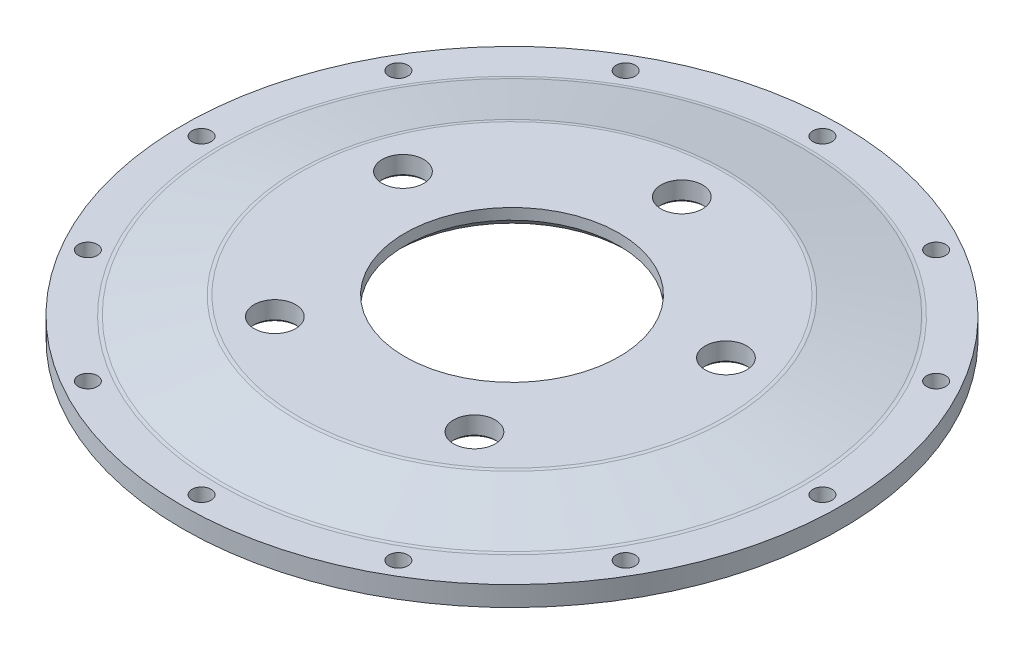
ISO-10303-21;
HEADER;
FILE_DESCRIPTION(('STEP AP214'),'2;1');
FILE_NAME('part.step','',(''),(''),'','','');
FILE_SCHEMA(('AUTOMOTIVE_DESIGN { 1 0 10303 214 1 1 1 1 }'));
ENDSEC;
DATA;
#1=APPLICATION_CONTEXT('core data for automotive mechanical design processes');
#2=APPLICATION_PROTOCOL_DEFINITION('international standard','automotive_design',2000,#1);
#3=PRODUCT_CONTEXT('',#1,'mechanical');
#4=PRODUCT('Part','Part','',(#3));
#5=PRODUCT_RELATED_PRODUCT_CATEGORY('part','',(#4));
#6=PRODUCT_DEFINITION_FORMATION('','',#4);
#7=PRODUCT_DEFINITION_CONTEXT('part definition',#1,'design');
#8=PRODUCT_DEFINITION('design','',#6,#7);
#9=PRODUCT_DEFINITION_SHAPE('','',#8);
#10=(LENGTH_UNIT() NAMED_UNIT(*) SI_UNIT(.MILLI.,.METRE.));
#11=(NAMED_UNIT(*) PLANE_ANGLE_UNIT() SI_UNIT($,.RADIAN.));
#12=(NAMED_UNIT(*) SI_UNIT($,.STERADIAN.) SOLID_ANGLE_UNIT());
#13=UNCERTAINTY_MEASURE_WITH_UNIT(LENGTH_MEASURE(1.E-05),#10,'distance_accuracy_value','');
#14=(GEOMETRIC_REPRESENTATION_CONTEXT(3) GLOBAL_UNCERTAINTY_ASSIGNED_CONTEXT((#13)) GLOBAL_UNIT_ASSIGNED_CONTEXT((#10,
#11,#12)) REPRESENTATION_CONTEXT('',''));
#15=CARTESIAN_POINT('',(0.,0.,0.));
#16=DIRECTION('',(0.,0.,1.));
#17=DIRECTION('',(1.,0.,0.));
#18=AXIS2_PLACEMENT_3D('',#15,#16,#17);
#19=CARTESIAN_POINT('',(0.,6.7,0.));
#20=DIRECTION('',(0.,1.,0.));
#21=DIRECTION('',(0.,0.,1.));
#22=AXIS2_PLACEMENT_3D('',#19,#20,#21);
#23=PLANE('',#22);
#24=CARTESIAN_POINT('',(0.,6.7,0.));
#25=DIRECTION('',(0.,1.,0.));
#26=DIRECTION('',(0.,0.,1.));
#27=AXIS2_PLACEMENT_3D('',#24,#25,#26);
#28=CIRCLE('',#27,98.6428439856109);
#29=CARTESIAN_POINT('',(0.,6.7,98.6428439856109));
#30=VERTEX_POINT('',#29);
#31=EDGE_CURVE('E91',#30,#30,#28,.F.);
#32=ORIENTED_EDGE('',*,*,#31,.T.);
#33=EDGE_LOOP('',(#32));
#34=FACE_BOUND('',#33,.T.);
#35=CARTESIAN_POINT('',(-90.4996546954717,6.7,-52.2499999999962));
#36=DIRECTION('',(0.,1.,0.));
#37=DIRECTION('',(0.,0.,1.));
#38=AXIS2_PLACEMENT_3D('',#35,#36,#37);
#39=CIRCLE('',#38,3.2125);
#40=CARTESIAN_POINT('',(-90.4996546954717,6.7,-49.0374999999962));
#41=VERTEX_POINT('',#40);
#42=EDGE_CURVE('E167',#41,#41,#39,.T.);
#43=ORIENTED_EDGE('',*,*,#42,.F.);
#44=EDGE_LOOP('',(#43));
#45=FACE_BOUND('',#44,.T.);
#46=CARTESIAN_POINT('',(-90.4996546954674,6.7,52.2500000000038));
#47=DIRECTION('',(0.,1.,0.));
#48=DIRECTION('',(0.,0.,1.));
#49=AXIS2_PLACEMENT_3D('',#46,#47,#48);
#50=CIRCLE('',#49,3.2125);
#51=CARTESIAN_POINT('',(-90.4996546954674,6.7,55.4625000000038));
#52=VERTEX_POINT('',#51);
#53=EDGE_CURVE('E155',#52,#52,#50,.T.);
#54=ORIENTED_EDGE('',*,*,#53,.F.);
#55=EDGE_LOOP('',(#54));
#56=FACE_BOUND('',#55,.T.);
#57=CARTESIAN_POINT('',(8.62839401912992E-12,6.7,104.5));
#58=DIRECTION('',(0.,1.,0.));
#59=DIRECTION('',(0.,0.,1.));
#60=AXIS2_PLACEMENT_3D('',#57,#58,#59);
#61=CIRCLE('',#60,3.2125);
#62=CARTESIAN_POINT('',(8.62839401912992E-12,6.7,107.7125));
#63=VERTEX_POINT('',#62);
#64=EDGE_CURVE('E143',#63,#63,#61,.T.);
#65=ORIENTED_EDGE('',*,*,#64,.F.);
#66=EDGE_LOOP('',(#65));
#67=FACE_BOUND('',#66,.T.);
#68=CARTESIAN_POINT('',(90.4996546954803,6.7,52.2499999999962));
#69=DIRECTION('',(0.,1.,0.));
#70=DIRECTION('',(0.,0.,1.));
#71=AXIS2_PLACEMENT_3D('',#68,#69,#70);
#72=CIRCLE('',#71,3.2125);
#73=CARTESIAN_POINT('',(90.4996546954803,6.7,55.4624999999963));
#74=VERTEX_POINT('',#73);
#75=EDGE_CURVE('E131',#74,#74,#72,.T.);
#76=ORIENTED_EDGE('',*,*,#75,.F.);
#77=EDGE_LOOP('',(#76));
#78=FACE_BOUND('',#77,.T.);
#79=CARTESIAN_POINT('',(90.499654695476,6.7,-52.2500000000037));
#80=DIRECTION('',(0.,1.,0.));
#81=DIRECTION('',(0.,0.,1.));
#82=AXIS2_PLACEMENT_3D('',#79,#80,#81);
#83=CIRCLE('',#82,3.2125);
#84=CARTESIAN_POINT('',(90.499654695476,6.7,-49.0375000000037));
#85=VERTEX_POINT('',#84);
#86=EDGE_CURVE('E119',#85,#85,#83,.T.);
#87=ORIENTED_EDGE('',*,*,#86,.F.);
#88=EDGE_LOOP('',(#87));
#89=FACE_BOUND('',#88,.T.);
#90=CARTESIAN_POINT('',(0.,6.7,-104.5));
#91=DIRECTION('',(0.,1.,0.));
#92=DIRECTION('',(0.,0.,1.));
#93=AXIS2_PLACEMENT_3D('',#90,#91,#92);
#94=CIRCLE('',#93,3.2125);
#95=CARTESIAN_POINT('',(0.,6.7,-101.2875));
#96=VERTEX_POINT('',#95);
#97=EDGE_CURVE('E107',#96,#96,#94,.T.);
#98=ORIENTED_EDGE('',*,*,#97,.F.);
#99=EDGE_LOOP('',(#98));
#100=FACE_BOUND('',#99,.T.);
#101=CARTESIAN_POINT('',(0.,6.7,0.));
#102=DIRECTION('',(0.,1.,0.));
#103=DIRECTION('',(0.,0.,1.));
#104=AXIS2_PLACEMENT_3D('',#101,#102,#103);
#105=CIRCLE('',#104,110.925);
#106=CARTESIAN_POINT('',(0.,6.7,110.925));
#107=VERTEX_POINT('',#106);
#108=EDGE_CURVE('E103',#107,#107,#105,.T.);
#109=ORIENTED_EDGE('',*,*,#108,.T.);
#110=EDGE_LOOP('',(#109));
#111=FACE_BOUND('',#110,.T.);
#112=CARTESIAN_POINT('',(52.2500000000006,6.7,-90.499654695476));
#113=DIRECTION('',(0.,1.,0.));
#114=DIRECTION('',(0.,0.,1.));
#115=AXIS2_PLACEMENT_3D('',#112,#113,#114);
#116=CIRCLE('',#115,3.21250000000001);
#117=CARTESIAN_POINT('',(52.2500000000006,6.7,-87.287154695476));
#118=VERTEX_POINT('',#117);
#119=EDGE_CURVE('E113',#118,#118,#116,.T.);
#120=ORIENTED_EDGE('',*,*,#119,.F.);
#121=EDGE_LOOP('',(#120));
#122=FACE_BOUND('',#121,.T.);
#123=CARTESIAN_POINT('',(104.500000000004,6.7,-4.31333762133219E-12));
#124=DIRECTION('',(0.,1.,0.));
#125=DIRECTION('',(0.,0.,1.));
#126=AXIS2_PLACEMENT_3D('',#123,#124,#125);
#127=CIRCLE('',#126,3.21249999999999);
#128=CARTESIAN_POINT('',(104.500000000004,6.7,3.21249999999568));
#129=VERTEX_POINT('',#128);
#130=EDGE_CURVE('E125',#129,#129,#127,.T.);
#131=ORIENTED_EDGE('',*,*,#130,.F.);
#132=EDGE_LOOP('',(#131));
#133=FACE_BOUND('',#132,.T.);
#134=CARTESIAN_POINT('',(52.2500000000081,6.7,90.4996546954717));
#135=DIRECTION('',(0.,1.,0.));
#136=DIRECTION('',(0.,0.,1.));
#137=AXIS2_PLACEMENT_3D('',#134,#135,#136);
#138=CIRCLE('',#137,3.2125);
#139=CARTESIAN_POINT('',(52.2500000000081,6.7,93.7121546954717));
#140=VERTEX_POINT('',#139);
#141=EDGE_CURVE('E137',#140,#140,#138,.T.);
#142=ORIENTED_EDGE('',*,*,#141,.F.);
#143=EDGE_LOOP('',(#142));
#144=FACE_BOUND('',#143,.T.);
#145=CARTESIAN_POINT('',(-52.2499999999919,6.7,90.499654695476));
#146=DIRECTION('',(0.,1.,0.));
#147=DIRECTION('',(0.,0.,1.));
#148=AXIS2_PLACEMENT_3D('',#145,#146,#147);
#149=CIRCLE('',#148,3.2125);
#150=CARTESIAN_POINT('',(-52.2499999999919,6.7,93.712154695476));
#151=VERTEX_POINT('',#150);
#152=EDGE_CURVE('E149',#151,#151,#149,.T.);
#153=ORIENTED_EDGE('',*,*,#152,.F.);
#154=EDGE_LOOP('',(#153));
#155=FACE_BOUND('',#154,.T.);
#156=CARTESIAN_POINT('',(-104.499999999996,6.7,4.32613518038328E-12));
#157=DIRECTION('',(0.,1.,0.));
#158=DIRECTION('',(0.,0.,1.));
#159=AXIS2_PLACEMENT_3D('',#156,#157,#158);
#160=CIRCLE('',#159,3.21249999999999);
#161=CARTESIAN_POINT('',(-104.499999999996,6.7,3.21250000000431));
#162=VERTEX_POINT('',#161);
#163=EDGE_CURVE('E161',#162,#162,#160,.T.);
#164=ORIENTED_EDGE('',*,*,#163,.F.);
#165=EDGE_LOOP('',(#164));
#166=FACE_BOUND('',#165,.T.);
#167=CARTESIAN_POINT('',(-52.2499999999995,6.7,-90.4996546954716));
#168=DIRECTION('',(0.,1.,0.));
#169=DIRECTION('',(0.,0.,1.));
#170=AXIS2_PLACEMENT_3D('',#167,#168,#169);
#171=CIRCLE('',#170,3.2125);
#172=CARTESIAN_POINT('',(-52.2499999999995,6.7,-87.2871546954716));
#173=VERTEX_POINT('',#172);
#174=EDGE_CURVE('E173',#173,#173,#171,.T.);
#175=ORIENTED_EDGE('',*,*,#174,.F.);
#176=EDGE_LOOP('',(#175));
#177=FACE_BOUND('',#176,.T.);
#178=ADVANCED_FACE('F35',(#34,#45,#56,#67,#78,#89,#100,#111,#122,#133,#144,#155,#166,#177),#23,.T.);
#179=CARTESIAN_POINT('',(0.,0.,0.));
#180=DIRECTION('',(0.,1.,0.));
#181=DIRECTION('',(0.,0.,1.));
#182=AXIS2_PLACEMENT_3D('',#179,#180,#181);
#183=PLANE('',#182);
#184=CARTESIAN_POINT('',(0.,0.,0.));
#185=DIRECTION('',(0.,1.,0.));
#186=DIRECTION('',(0.,0.,1.));
#187=AXIS2_PLACEMENT_3D('',#184,#185,#186);
#188=CIRCLE('',#187,98.3589219928054);
#189=CARTESIAN_POINT('',(0.,0.,98.3589219928054));
#190=VERTEX_POINT('',#189);
#191=EDGE_CURVE('E10',#190,#190,#188,.T.);
#192=ORIENTED_EDGE('',*,*,#191,.T.);
#193=EDGE_LOOP('',(#192));
#194=FACE_BOUND('',#193,.T.);
#195=CARTESIAN_POINT('',(0.,0.,0.));
#196=DIRECTION('',(0.,1.,0.));
#197=DIRECTION('',(0.,0.,1.));
#198=AXIS2_PLACEMENT_3D('',#195,#196,#197);
#199=CIRCLE('',#198,110.925);
#200=CARTESIAN_POINT('',(0.,0.,110.925));
#201=VERTEX_POINT('',#200);
#202=EDGE_CURVE('E104',#201,#201,#199,.T.);
#203=ORIENTED_EDGE('',*,*,#202,.F.);
#204=EDGE_LOOP('',(#203));
#205=FACE_BOUND('',#204,.T.);
#206=CARTESIAN_POINT('',(0.,0.,-104.5));
#207=DIRECTION('',(0.,1.,0.));
#208=DIRECTION('',(0.,0.,1.));
#209=AXIS2_PLACEMENT_3D('',#206,#207,#208);
#210=CIRCLE('',#209,3.2125);
#211=CARTESIAN_POINT('',(0.,0.,-101.2875));
#212=VERTEX_POINT('',#211);
#213=EDGE_CURVE('E110',#212,#212,#210,.T.);
#214=ORIENTED_EDGE('',*,*,#213,.T.);
#215=EDGE_LOOP('',(#214));
#216=FACE_BOUND('',#215,.T.);
#217=CARTESIAN_POINT('',(52.2500000000006,0.,-90.499654695476));
#218=DIRECTION('',(0.,1.,0.));
#219=DIRECTION('',(0.,0.,1.));
#220=AXIS2_PLACEMENT_3D('',#217,#218,#219);
#221=CIRCLE('',#220,3.21250000000001);
#222=CARTESIAN_POINT('',(52.2500000000006,0.,-87.287154695476));
#223=VERTEX_POINT('',#222);
#224=EDGE_CURVE('E116',#223,#223,#221,.T.);
#225=ORIENTED_EDGE('',*,*,#224,.T.);
#226=EDGE_LOOP('',(#225));
#227=FACE_BOUND('',#226,.T.);
#228=CARTESIAN_POINT('',(90.499654695476,0.,-52.2500000000037));
#229=DIRECTION('',(0.,1.,0.));
#230=DIRECTION('',(0.,0.,1.));
#231=AXIS2_PLACEMENT_3D('',#228,#229,#230);
#232=CIRCLE('',#231,3.2125);
#233=CARTESIAN_POINT('',(90.499654695476,0.,-49.0375000000037));
#234=VERTEX_POINT('',#233);
#235=EDGE_CURVE('E122',#234,#234,#232,.T.);
#236=ORIENTED_EDGE('',*,*,#235,.T.);
#237=EDGE_LOOP('',(#236));
#238=FACE_BOUND('',#237,.T.);
#239=CARTESIAN_POINT('',(104.500000000004,0.,-4.31333762133219E-12));
#240=DIRECTION('',(0.,1.,0.));
#241=DIRECTION('',(0.,0.,1.));
#242=AXIS2_PLACEMENT_3D('',#239,#240,#241);
#243=CIRCLE('',#242,3.21249999999999);
#244=CARTESIAN_POINT('',(104.500000000004,0.,3.21249999999568));
#245=VERTEX_POINT('',#244);
#246=EDGE_CURVE('E128',#245,#245,#243,.T.);
#247=ORIENTED_EDGE('',*,*,#246,.T.);
#248=EDGE_LOOP('',(#247));
#249=FACE_BOUND('',#248,.T.);
#250=CARTESIAN_POINT('',(90.4996546954803,0.,52.2499999999962));
#251=DIRECTION('',(0.,1.,0.));
#252=DIRECTION('',(0.,0.,1.));
#253=AXIS2_PLACEMENT_3D('',#250,#251,#252);
#254=CIRCLE('',#253,3.2125);
#255=CARTESIAN_POINT('',(90.4996546954803,0.,55.4624999999963));
#256=VERTEX_POINT('',#255);
#257=EDGE_CURVE('E134',#256,#256,#254,.T.);
#258=ORIENTED_EDGE('',*,*,#257,.T.);
#259=EDGE_LOOP('',(#258));
#260=FACE_BOUND('',#259,.T.);
#261=CARTESIAN_POINT('',(52.2500000000081,0.,90.4996546954717));
#262=DIRECTION('',(0.,1.,0.));
#263=DIRECTION('',(0.,0.,1.));
#264=AXIS2_PLACEMENT_3D('',#261,#262,#263);
#265=CIRCLE('',#264,3.2125);
#266=CARTESIAN_POINT('',(52.2500000000081,0.,93.7121546954717));
#267=VERTEX_POINT('',#266);
#268=EDGE_CURVE('E140',#267,#267,#265,.T.);
#269=ORIENTED_EDGE('',*,*,#268,.T.);
#270=EDGE_LOOP('',(#269));
#271=FACE_BOUND('',#270,.T.);
#272=CARTESIAN_POINT('',(8.62839401912992E-12,0.,104.5));
#273=DIRECTION('',(0.,1.,0.));
#274=DIRECTION('',(0.,0.,1.));
#275=AXIS2_PLACEMENT_3D('',#272,#273,#274);
#276=CIRCLE('',#275,3.2125);
#277=CARTESIAN_POINT('',(8.62839401912992E-12,0.,107.7125));
#278=VERTEX_POINT('',#277);
#279=EDGE_CURVE('E146',#278,#278,#276,.T.);
#280=ORIENTED_EDGE('',*,*,#279,.T.);
#281=EDGE_LOOP('',(#280));
#282=FACE_BOUND('',#281,.T.);
#283=CARTESIAN_POINT('',(-52.2499999999919,0.,90.499654695476));
#284=DIRECTION('',(0.,1.,0.));
#285=DIRECTION('',(0.,0.,1.));
#286=AXIS2_PLACEMENT_3D('',#283,#284,#285);
#287=CIRCLE('',#286,3.2125);
#288=CARTESIAN_POINT('',(-52.2499999999919,0.,93.712154695476));
#289=VERTEX_POINT('',#288);
#290=EDGE_CURVE('E152',#289,#289,#287,.T.);
#291=ORIENTED_EDGE('',*,*,#290,.T.);
#292=EDGE_LOOP('',(#291));
#293=FACE_BOUND('',#292,.T.);
#294=CARTESIAN_POINT('',(-90.4996546954674,0.,52.2500000000038));
#295=DIRECTION('',(0.,1.,0.));
#296=DIRECTION('',(0.,0.,1.));
#297=AXIS2_PLACEMENT_3D('',#294,#295,#296);
#298=CIRCLE('',#297,3.2125);
#299=CARTESIAN_POINT('',(-90.4996546954674,0.,55.4625000000038));
#300=VERTEX_POINT('',#299);
#301=EDGE_CURVE('E158',#300,#300,#298,.T.);
#302=ORIENTED_EDGE('',*,*,#301,.T.);
#303=EDGE_LOOP('',(#302));
#304=FACE_BOUND('',#303,.T.);
#305=CARTESIAN_POINT('',(-104.499999999996,0.,4.32613518038328E-12));
#306=DIRECTION('',(0.,1.,0.));
#307=DIRECTION('',(0.,0.,1.));
#308=AXIS2_PLACEMENT_3D('',#305,#306,#307);
#309=CIRCLE('',#308,3.21249999999999);
#310=CARTESIAN_POINT('',(-104.499999999996,0.,3.21250000000431));
#311=VERTEX_POINT('',#310);
#312=EDGE_CURVE('E164',#311,#311,#309,.T.);
#313=ORIENTED_EDGE('',*,*,#312,.T.);
#314=EDGE_LOOP('',(#313));
#315=FACE_BOUND('',#314,.T.);
#316=CARTESIAN_POINT('',(-90.4996546954717,0.,-52.2499999999962));
#317=DIRECTION('',(0.,1.,0.));
#318=DIRECTION('',(0.,0.,1.));
#319=AXIS2_PLACEMENT_3D('',#316,#317,#318);
#320=CIRCLE('',#319,3.2125);
#321=CARTESIAN_POINT('',(-90.4996546954717,0.,-49.0374999999962));
#322=VERTEX_POINT('',#321);
#323=EDGE_CURVE('E170',#322,#322,#320,.T.);
#324=ORIENTED_EDGE('',*,*,#323,.T.);
#325=EDGE_LOOP('',(#324));
#326=FACE_BOUND('',#325,.T.);
#327=CARTESIAN_POINT('',(-52.2499999999995,0.,-90.4996546954716));
#328=DIRECTION('',(0.,1.,0.));
#329=DIRECTION('',(0.,0.,1.));
#330=AXIS2_PLACEMENT_3D('',#327,#328,#329);
#331=CIRCLE('',#330,3.2125);
#332=CARTESIAN_POINT('',(-52.2499999999995,0.,-87.2871546954716));
#333=VERTEX_POINT('',#332);
#334=EDGE_CURVE('E176',#333,#333,#331,.T.);
#335=ORIENTED_EDGE('',*,*,#334,.T.);
#336=EDGE_LOOP('',(#335));
#337=FACE_BOUND('',#336,.T.);
#338=ADVANCED_FACE('F231',(#194,#205,#216,#227,#238,#249,#260,#271,#282,#293,#304,#315,#326,
#337),#183,.F.);
#339=CARTESIAN_POINT('',(0.,6.7,0.));
#340=DIRECTION('',(0.,-1.,0.));
#341=DIRECTION('',(0.,0.,-1.));
#342=AXIS2_PLACEMENT_3D('',#339,#340,#341);
#343=CYLINDRICAL_SURFACE('',#342,110.925);
#344=ORIENTED_EDGE('',*,*,#108,.F.);
#345=EDGE_LOOP('',(#344));
#346=FACE_BOUND('',#345,.T.);
#347=ORIENTED_EDGE('',*,*,#202,.T.);
#348=EDGE_LOOP('',(#347));
#349=FACE_BOUND('',#348,.T.);
#350=ADVANCED_FACE('F237',(#346,#349),#343,.T.);
#351=CARTESIAN_POINT('',(0.,6.7,-104.5));
#352=DIRECTION('',(0.,-1.,0.));
#353=DIRECTION('',(0.,0.,-1.));
#354=AXIS2_PLACEMENT_3D('',#351,#352,#353);
#355=CYLINDRICAL_SURFACE('',#354,3.2125);
#356=ORIENTED_EDGE('',*,*,#97,.T.);
#357=EDGE_LOOP('',(#356));
#358=FACE_BOUND('',#357,.T.);
#359=ORIENTED_EDGE('',*,*,#213,.F.);
#360=EDGE_LOOP('',(#359));
#361=FACE_BOUND('',#360,.T.);
#362=ADVANCED_FACE('F241',(#358,#361),#355,.F.);
#363=CARTESIAN_POINT('',(52.2500000000006,6.7,-90.499654695476));
#364=DIRECTION('',(0.,-1.,0.));
#365=DIRECTION('',(0.,0.,-1.));
#366=AXIS2_PLACEMENT_3D('',#363,#364,#365);
#367=CYLINDRICAL_SURFACE('',#366,3.21250000000001);
#368=ORIENTED_EDGE('',*,*,#119,.T.);
#369=EDGE_LOOP('',(#368));
#370=FACE_BOUND('',#369,.T.);
#371=ORIENTED_EDGE('',*,*,#224,.F.);
#372=EDGE_LOOP('',(#371));
#373=FACE_BOUND('',#372,.T.);
#374=ADVANCED_FACE('F356',(#370,#373),#367,.F.);
#375=CARTESIAN_POINT('',(90.499654695476,6.7,-52.2500000000037));
#376=DIRECTION('',(0.,-1.,0.));
#377=DIRECTION('',(0.,0.,-1.));
#378=AXIS2_PLACEMENT_3D('',#375,#376,#377);
#379=CYLINDRICAL_SURFACE('',#378,3.2125);
#380=ORIENTED_EDGE('',*,*,#86,.T.);
#381=EDGE_LOOP('',(#380));
#382=FACE_BOUND('',#381,.T.);
#383=ORIENTED_EDGE('',*,*,#235,.F.);
#384=EDGE_LOOP('',(#383));
#385=FACE_BOUND('',#384,.T.);
#386=ADVANCED_FACE('F353',(#382,#385),#379,.F.);
#387=CARTESIAN_POINT('',(104.500000000004,6.7,-4.31333762133219E-12));
#388=DIRECTION('',(0.,-1.,0.));
#389=DIRECTION('',(0.,0.,-1.));
#390=AXIS2_PLACEMENT_3D('',#387,#388,#389);
#391=CYLINDRICAL_SURFACE('',#390,3.21249999999999);
#392=ORIENTED_EDGE('',*,*,#130,.T.);
#393=EDGE_LOOP('',(#392));
#394=FACE_BOUND('',#393,.T.);
#395=ORIENTED_EDGE('',*,*,#246,.F.);
#396=EDGE_LOOP('',(#395));
#397=FACE_BOUND('',#396,.T.);
#398=ADVANCED_FACE('F349',(#394,#397),#391,.F.);
#399=CARTESIAN_POINT('',(90.4996546954803,6.7,52.2499999999962));
#400=DIRECTION('',(0.,-1.,0.));
#401=DIRECTION('',(0.,0.,-1.));
#402=AXIS2_PLACEMENT_3D('',#399,#400,#401);
#403=CYLINDRICAL_SURFACE('',#402,3.2125);
#404=ORIENTED_EDGE('',*,*,#75,.T.);
#405=EDGE_LOOP('',(#404));
#406=FACE_BOUND('',#405,.T.);
#407=ORIENTED_EDGE('',*,*,#257,.F.);
#408=EDGE_LOOP('',(#407));
#409=FACE_BOUND('',#408,.T.);
#410=ADVANCED_FACE('F345',(#406,#409),#403,.F.);
#411=CARTESIAN_POINT('',(52.2500000000081,6.7,90.4996546954717));
#412=DIRECTION('',(0.,-1.,0.));
#413=DIRECTION('',(0.,0.,-1.));
#414=AXIS2_PLACEMENT_3D('',#411,#412,#413);
#415=CYLINDRICAL_SURFACE('',#414,3.2125);
#416=ORIENTED_EDGE('',*,*,#141,.T.);
#417=EDGE_LOOP('',(#416));
#418=FACE_BOUND('',#417,.T.);
#419=ORIENTED_EDGE('',*,*,#268,.F.);
#420=EDGE_LOOP('',(#419));
#421=FACE_BOUND('',#420,.T.);
#422=ADVANCED_FACE('F341',(#418,#421),#415,.F.);
#423=CARTESIAN_POINT('',(8.62839401912992E-12,6.7,104.5));
#424=DIRECTION('',(0.,-1.,0.));
#425=DIRECTION('',(0.,0.,-1.));
#426=AXIS2_PLACEMENT_3D('',#423,#424,#425);
#427=CYLINDRICAL_SURFACE('',#426,3.2125);
#428=ORIENTED_EDGE('',*,*,#64,.T.);
#429=EDGE_LOOP('',(#428));
#430=FACE_BOUND('',#429,.T.);
#431=ORIENTED_EDGE('',*,*,#279,.F.);
#432=EDGE_LOOP('',(#431));
#433=FACE_BOUND('',#432,.T.);
#434=ADVANCED_FACE('F337',(#430,#433),#427,.F.);
#435=CARTESIAN_POINT('',(-52.2499999999919,6.7,90.499654695476));
#436=DIRECTION('',(0.,-1.,0.));
#437=DIRECTION('',(0.,0.,-1.));
#438=AXIS2_PLACEMENT_3D('',#435,#436,#437);
#439=CYLINDRICAL_SURFACE('',#438,3.2125);
#440=ORIENTED_EDGE('',*,*,#152,.T.);
#441=EDGE_LOOP('',(#440));
#442=FACE_BOUND('',#441,.T.);
#443=ORIENTED_EDGE('',*,*,#290,.F.);
#444=EDGE_LOOP('',(#443));
#445=FACE_BOUND('',#444,.T.);
#446=ADVANCED_FACE('F333',(#442,#445),#439,.F.);
#447=CARTESIAN_POINT('',(-90.4996546954674,6.7,52.2500000000038));
#448=DIRECTION('',(0.,-1.,0.));
#449=DIRECTION('',(0.,0.,-1.));
#450=AXIS2_PLACEMENT_3D('',#447,#448,#449);
#451=CYLINDRICAL_SURFACE('',#450,3.2125);
#452=ORIENTED_EDGE('',*,*,#53,.T.);
#453=EDGE_LOOP('',(#452));
#454=FACE_BOUND('',#453,.T.);
#455=ORIENTED_EDGE('',*,*,#301,.F.);
#456=EDGE_LOOP('',(#455));
#457=FACE_BOUND('',#456,.T.);
#458=ADVANCED_FACE('F329',(#454,#457),#451,.F.);
#459=CARTESIAN_POINT('',(-104.499999999996,6.7,4.32613518038328E-12));
#460=DIRECTION('',(0.,-1.,0.));
#461=DIRECTION('',(0.,0.,-1.));
#462=AXIS2_PLACEMENT_3D('',#459,#460,#461);
#463=CYLINDRICAL_SURFACE('',#462,3.21249999999999);
#464=ORIENTED_EDGE('',*,*,#163,.T.);
#465=EDGE_LOOP('',(#464));
#466=FACE_BOUND('',#465,.T.);
#467=ORIENTED_EDGE('',*,*,#312,.F.);
#468=EDGE_LOOP('',(#467));
#469=FACE_BOUND('',#468,.T.);
#470=ADVANCED_FACE('F325',(#466,#469),#463,.F.);
#471=CARTESIAN_POINT('',(-90.4996546954717,6.7,-52.2499999999962));
#472=DIRECTION('',(0.,-1.,0.));
#473=DIRECTION('',(0.,0.,-1.));
#474=AXIS2_PLACEMENT_3D('',#471,#472,#473);
#475=CYLINDRICAL_SURFACE('',#474,3.2125);
#476=ORIENTED_EDGE('',*,*,#42,.T.);
#477=EDGE_LOOP('',(#476));
#478=FACE_BOUND('',#477,.T.);
#479=ORIENTED_EDGE('',*,*,#323,.F.);
#480=EDGE_LOOP('',(#479));
#481=FACE_BOUND('',#480,.T.);
#482=ADVANCED_FACE('F321',(#478,#481),#475,.F.);
#483=CARTESIAN_POINT('',(-52.2499999999995,6.7,-90.4996546954716));
#484=DIRECTION('',(0.,-1.,0.));
#485=DIRECTION('',(0.,0.,-1.));
#486=AXIS2_PLACEMENT_3D('',#483,#484,#485);
#487=CYLINDRICAL_SURFACE('',#486,3.2125);
#488=ORIENTED_EDGE('',*,*,#174,.T.);
#489=EDGE_LOOP('',(#488));
#490=FACE_BOUND('',#489,.T.);
#491=ORIENTED_EDGE('',*,*,#334,.F.);
#492=EDGE_LOOP('',(#491));
#493=FACE_BOUND('',#492,.T.);
#494=ADVANCED_FACE('F317',(#490,#493),#487,.F.);
#495=CARTESIAN_POINT('',(0.,6.7,0.));
#496=DIRECTION('',(0.,-1.,0.));
#497=DIRECTION('',(0.,0.,-1.));
#498=AXIS2_PLACEMENT_3D('',#495,#496,#497);
#499=CONICAL_SURFACE('',#498,98.075,1.34462777489678);
#500=CARTESIAN_POINT('',(0.,6.82733634890942,0.));
#501=DIRECTION('',(0.,-1.,0.));
#502=DIRECTION('',(0.,0.,-1.));
#503=AXIS2_PLACEMENT_3D('',#500,#501,#502);
#504=CIRCLE('',#503,97.5216174503647);
#505=CARTESIAN_POINT('',(0.,6.82733634890942,-97.5216174503647));
#506=VERTEX_POINT('',#505);
#507=EDGE_CURVE('E94',#506,#506,#504,.F.);
#508=ORIENTED_EDGE('',*,*,#507,.T.);
#509=EDGE_LOOP('',(#508));
#510=FACE_BOUND('',#509,.T.);
#511=CARTESIAN_POINT('',(0.,12.5726636510906,0.));
#512=DIRECTION('',(0.,1.,0.));
#513=DIRECTION('',(0.,0.,1.));
#514=AXIS2_PLACEMENT_3D('',#511,#512,#513);
#515=CIRCLE('',#514,72.5533825496353);
#516=CARTESIAN_POINT('',(0.,12.5726636510906,72.5533825496353));
#517=VERTEX_POINT('',#516);
#518=EDGE_CURVE('E97',#517,#517,#515,.F.);
#519=ORIENTED_EDGE('',*,*,#518,.T.);
#520=EDGE_LOOP('',(#519));
#521=FACE_BOUND('',#520,.T.);
#522=ADVANCED_FACE('F312',(#510,#521),#499,.T.);
#523=CARTESIAN_POINT('',(0.,6.,0.));
#524=DIRECTION('',(0.,-1.,0.));
#525=DIRECTION('',(0.,0.,-1.));
#526=AXIS2_PLACEMENT_3D('',#523,#524,#525);
#527=CONICAL_SURFACE('',#526,72.,1.34462777489678);
#528=CARTESIAN_POINT('',(0.,0.0636681744546896,0.));
#529=DIRECTION('',(0.,-1.,0.));
#530=DIRECTION('',(0.,0.,-1.));
#531=AXIS2_PLACEMENT_3D('',#528,#529,#530);
#532=CIRCLE('',#531,97.7983087251823);
#533=CARTESIAN_POINT('',(0.,0.0636681744546896,-97.7983087251823));
#534=VERTEX_POINT('',#533);
#535=EDGE_CURVE('E42',#534,#534,#532,.T.);
#536=ORIENTED_EDGE('',*,*,#535,.T.);
#537=EDGE_LOOP('',(#536));
#538=FACE_BOUND('',#537,.T.);
#539=CARTESIAN_POINT('',(0.,5.93633182554531,0.));
#540=DIRECTION('',(0.,1.,0.));
#541=DIRECTION('',(0.,0.,1.));
#542=AXIS2_PLACEMENT_3D('',#539,#540,#541);
#543=CIRCLE('',#542,72.2766912748177);
#544=CARTESIAN_POINT('',(0.,5.93633182554531,72.2766912748177));
#545=VERTEX_POINT('',#544);
#546=EDGE_CURVE('E46',#545,#545,#543,.T.);
#547=ORIENTED_EDGE('',*,*,#546,.T.);
#548=EDGE_LOOP('',(#547));
#549=FACE_BOUND('',#548,.T.);
#550=ADVANCED_FACE('F291',(#538,#549),#527,.F.);
#551=CARTESIAN_POINT('',(0.,6.,0.));
#552=DIRECTION('',(0.,1.,0.));
#553=DIRECTION('',(0.,0.,1.));
#554=AXIS2_PLACEMENT_3D('',#551,#552,#553);
#555=PLANE('',#554);
#556=CARTESIAN_POINT('',(0.,6.,0.));
#557=DIRECTION('',(0.,1.,0.));
#558=DIRECTION('',(0.,0.,1.));
#559=AXIS2_PLACEMENT_3D('',#556,#557,#558);
#560=CIRCLE('',#559,71.7160780071946);
#561=CARTESIAN_POINT('',(0.,6.,71.7160780071946));
#562=VERTEX_POINT('',#561);
#563=EDGE_CURVE('E50',#562,#562,#560,.F.);
#564=ORIENTED_EDGE('',*,*,#563,.T.);
#565=EDGE_LOOP('',(#564));
#566=FACE_BOUND('',#565,.T.);
#567=CARTESIAN_POINT('',(0.,6.,-57.15));
#568=DIRECTION('',(0.,1.,0.));
#569=DIRECTION('',(0.,0.,1.));
#570=AXIS2_PLACEMENT_3D('',#567,#568,#569);
#571=CIRCLE('',#570,7.79999999999993);
#572=CARTESIAN_POINT('',(0.,6.,-49.3500000000001));
#573=VERTEX_POINT('',#572);
#574=EDGE_CURVE('E70',#573,#573,#571,.T.);
#575=ORIENTED_EDGE('',*,*,#574,.T.);
#576=EDGE_LOOP('',(#575));
#577=FACE_BOUND('',#576,.T.);
#578=CARTESIAN_POINT('',(54.3528799062697,6.,-17.6603212285306));
#579=DIRECTION('',(0.,1.,0.));
#580=DIRECTION('',(0.,0.,1.));
#581=AXIS2_PLACEMENT_3D('',#578,#579,#580);
#582=CIRCLE('',#581,7.800000000001);
#583=CARTESIAN_POINT('',(54.3528799062697,6.,-9.86032122852956));
#584=VERTEX_POINT('',#583);
#585=EDGE_CURVE('E73',#584,#584,#582,.T.);
#586=ORIENTED_EDGE('',*,*,#585,.T.);
#587=EDGE_LOOP('',(#586));
#588=FACE_BOUND('',#587,.T.);
#589=CARTESIAN_POINT('',(33.5919271685192,6.,46.2353212285268));
#590=DIRECTION('',(0.,1.,0.));
#591=DIRECTION('',(0.,0.,1.));
#592=AXIS2_PLACEMENT_3D('',#589,#590,#591);
#593=CIRCLE('',#592,7.800000000004);
#594=CARTESIAN_POINT('',(33.5919271685192,6.,54.0353212285308));
#595=VERTEX_POINT('',#594);
#596=EDGE_CURVE('E76',#595,#595,#593,.T.);
#597=ORIENTED_EDGE('',*,*,#596,.T.);
#598=EDGE_LOOP('',(#597));
#599=FACE_BOUND('',#598,.T.);
#600=CARTESIAN_POINT('',(-33.5919271685105,6.,46.2353212285297));
#601=DIRECTION('',(0.,1.,0.));
#602=DIRECTION('',(0.,0.,1.));
#603=AXIS2_PLACEMENT_3D('',#600,#601,#602);
#604=CIRCLE('',#603,7.80000000000511);
#605=CARTESIAN_POINT('',(-33.5919271685105,6.,54.0353212285348));
#606=VERTEX_POINT('',#605);
#607=EDGE_CURVE('E79',#606,#606,#604,.T.);
#608=ORIENTED_EDGE('',*,*,#607,.T.);
#609=EDGE_LOOP('',(#608));
#610=FACE_BOUND('',#609,.T.);
#611=CARTESIAN_POINT('',(-54.3528799062664,6.,-17.6603212285259));
#612=DIRECTION('',(0.,1.,0.));
#613=DIRECTION('',(0.,0.,1.));
#614=AXIS2_PLACEMENT_3D('',#611,#612,#613);
#615=CIRCLE('',#614,7.80000000000289);
#616=CARTESIAN_POINT('',(-54.3528799062664,6.,-9.86032122852304));
#617=VERTEX_POINT('',#616);
#618=EDGE_CURVE('E82',#617,#617,#615,.T.);
#619=ORIENTED_EDGE('',*,*,#618,.T.);
#620=EDGE_LOOP('',(#619));
#621=FACE_BOUND('',#620,.T.);
#622=CARTESIAN_POINT('',(0.,6.,0.));
#623=DIRECTION('',(0.,1.,0.));
#624=DIRECTION('',(0.,0.,1.));
#625=AXIS2_PLACEMENT_3D('',#622,#623,#624);
#626=CIRCLE('',#625,39.055);
#627=CARTESIAN_POINT('',(0.,6.,39.055));
#628=VERTEX_POINT('',#627);
#629=EDGE_CURVE('E88',#628,#628,#626,.T.);
#630=ORIENTED_EDGE('',*,*,#629,.T.);
#631=EDGE_LOOP('',(#630));
#632=FACE_BOUND('',#631,.T.);
#633=ADVANCED_FACE('F206',(#566,#577,#588,#599,#610,#621,#632),#555,.F.);
#634=CARTESIAN_POINT('',(0.,12.7,0.));
#635=DIRECTION('',(0.,1.,0.));
#636=DIRECTION('',(0.,0.,1.));
#637=AXIS2_PLACEMENT_3D('',#634,#635,#636);
#638=PLANE('',#637);
#639=CARTESIAN_POINT('',(0.,12.7,0.));
#640=DIRECTION('',(0.,1.,0.));
#641=DIRECTION('',(0.,0.,1.));
#642=AXIS2_PLACEMENT_3D('',#639,#640,#641);
#643=CIRCLE('',#642,71.4321560143891);
#644=CARTESIAN_POINT('',(0.,12.7,71.4321560143891));
#645=VERTEX_POINT('',#644);
#646=EDGE_CURVE('E100',#645,#645,#643,.T.);
#647=ORIENTED_EDGE('',*,*,#646,.T.);
#648=EDGE_LOOP('',(#647));
#649=FACE_BOUND('',#648,.T.);
#650=CARTESIAN_POINT('',(-54.3528799062664,12.7,-17.6603212285259));
#651=DIRECTION('',(0.,1.,0.));
#652=DIRECTION('',(0.,0.,1.));
#653=AXIS2_PLACEMENT_3D('',#650,#651,#652);
#654=CIRCLE('',#653,7.00000000000291);
#655=CARTESIAN_POINT('',(-54.3528799062664,12.7,-10.660321228523));
#656=VERTEX_POINT('',#655);
#657=EDGE_CURVE('E196',#656,#656,#654,.T.);
#658=ORIENTED_EDGE('',*,*,#657,.F.);
#659=EDGE_LOOP('',(#658));
#660=FACE_BOUND('',#659,.T.);
#661=CARTESIAN_POINT('',(-33.5919271685105,12.7,46.2353212285297));
#662=DIRECTION('',(0.,1.,0.));
#663=DIRECTION('',(0.,0.,1.));
#664=AXIS2_PLACEMENT_3D('',#661,#662,#663);
#665=CIRCLE('',#664,7.00000000000508);
#666=CARTESIAN_POINT('',(-33.5919271685105,12.7,53.2353212285348));
#667=VERTEX_POINT('',#666);
#668=EDGE_CURVE('E193',#667,#667,#665,.T.);
#669=ORIENTED_EDGE('',*,*,#668,.F.);
#670=EDGE_LOOP('',(#669));
#671=FACE_BOUND('',#670,.T.);
#672=CARTESIAN_POINT('',(33.5919271685192,12.7,46.2353212285268));
#673=DIRECTION('',(0.,1.,0.));
#674=DIRECTION('',(0.,0.,1.));
#675=AXIS2_PLACEMENT_3D('',#672,#673,#674);
#676=CIRCLE('',#675,7.00000000000409);
#677=CARTESIAN_POINT('',(33.5919271685192,12.7,53.2353212285309));
#678=VERTEX_POINT('',#677);
#679=EDGE_CURVE('E190',#678,#678,#676,.T.);
#680=ORIENTED_EDGE('',*,*,#679,.F.);
#681=EDGE_LOOP('',(#680));
#682=FACE_BOUND('',#681,.T.);
#683=CARTESIAN_POINT('',(54.3528799062697,12.7,-17.6603212285306));
#684=DIRECTION('',(0.,1.,0.));
#685=DIRECTION('',(0.,0.,1.));
#686=AXIS2_PLACEMENT_3D('',#683,#684,#685);
#687=CIRCLE('',#686,7.00000000000109);
#688=CARTESIAN_POINT('',(54.3528799062697,12.7,-10.6603212285295));
#689=VERTEX_POINT('',#688);
#690=EDGE_CURVE('E187',#689,#689,#687,.T.);
#691=ORIENTED_EDGE('',*,*,#690,.F.);
#692=EDGE_LOOP('',(#691));
#693=FACE_BOUND('',#692,.T.);
#694=CARTESIAN_POINT('',(0.,12.7,-57.15));
#695=DIRECTION('',(0.,1.,0.));
#696=DIRECTION('',(0.,0.,1.));
#697=AXIS2_PLACEMENT_3D('',#694,#695,#696);
#698=CIRCLE('',#697,7.);
#699=CARTESIAN_POINT('',(0.,12.7,-50.15));
#700=VERTEX_POINT('',#699);
#701=EDGE_CURVE('E184',#700,#700,#698,.T.);
#702=ORIENTED_EDGE('',*,*,#701,.F.);
#703=EDGE_LOOP('',(#702));
#704=FACE_BOUND('',#703,.T.);
#705=CARTESIAN_POINT('',(0.,12.7,0.));
#706=DIRECTION('',(0.,1.,0.));
#707=DIRECTION('',(0.,0.,1.));
#708=AXIS2_PLACEMENT_3D('',#705,#706,#707);
#709=CIRCLE('',#708,36.055);
#710=CARTESIAN_POINT('',(0.,12.7,36.055));
#711=VERTEX_POINT('',#710);
#712=EDGE_CURVE('E179',#711,#711,#709,.T.);
#713=ORIENTED_EDGE('',*,*,#712,.F.);
#714=EDGE_LOOP('',(#713));
#715=FACE_BOUND('',#714,.T.);
#716=ADVANCED_FACE('F202',(#649,#660,#671,#682,#693,#704,#715),#638,.T.);
#717=CARTESIAN_POINT('',(0.,6.,0.));
#718=DIRECTION('',(0.,1.,0.));
#719=DIRECTION('',(0.,0.,1.));
#720=AXIS2_PLACEMENT_3D('',#717,#718,#719);
#721=CYLINDRICAL_SURFACE('',#720,36.055);
#722=CARTESIAN_POINT('',(0.,9.00000000000002,0.));
#723=DIRECTION('',(0.,1.,0.));
#724=DIRECTION('',(0.,0.,1.));
#725=AXIS2_PLACEMENT_3D('',#722,#723,#724);
#726=CIRCLE('',#725,36.055);
#727=CARTESIAN_POINT('',(0.,9.00000000000002,36.055));
#728=VERTEX_POINT('',#727);
#729=EDGE_CURVE('E85',#728,#728,#726,.F.);
#730=ORIENTED_EDGE('',*,*,#729,.T.);
#731=EDGE_LOOP('',(#730));
#732=FACE_BOUND('',#731,.T.);
#733=ORIENTED_EDGE('',*,*,#712,.T.);
#734=EDGE_LOOP('',(#733));
#735=FACE_BOUND('',#734,.T.);
#736=ADVANCED_FACE('F205',(#732,#735),#721,.F.);
#737=CARTESIAN_POINT('',(0.,6.,-57.15));
#738=DIRECTION('',(0.,1.,0.));
#739=DIRECTION('',(0.,0.,1.));
#740=AXIS2_PLACEMENT_3D('',#737,#738,#739);
#741=CYLINDRICAL_SURFACE('',#740,7.);
#742=CARTESIAN_POINT('',(0.,6.79999999999994,-57.15));
#743=DIRECTION('',(0.,1.,0.));
#744=DIRECTION('',(0.,0.,1.));
#745=AXIS2_PLACEMENT_3D('',#742,#743,#744);
#746=CIRCLE('',#745,7.);
#747=CARTESIAN_POINT('',(0.,6.79999999999994,-50.15));
#748=VERTEX_POINT('',#747);
#749=EDGE_CURVE('E67',#748,#748,#746,.F.);
#750=ORIENTED_EDGE('',*,*,#749,.T.);
#751=EDGE_LOOP('',(#750));
#752=FACE_BOUND('',#751,.T.);
#753=ORIENTED_EDGE('',*,*,#701,.T.);
#754=EDGE_LOOP('',(#753));
#755=FACE_BOUND('',#754,.T.);
#756=ADVANCED_FACE('F220',(#752,#755),#741,.F.);
#757=CARTESIAN_POINT('',(54.3528799062697,6.,-17.6603212285306));
#758=DIRECTION('',(0.,1.,0.));
#759=DIRECTION('',(0.,0.,1.));
#760=AXIS2_PLACEMENT_3D('',#757,#758,#759);
#761=CYLINDRICAL_SURFACE('',#760,7.00000000000109);
#762=CARTESIAN_POINT('',(54.3528799062697,6.7999999999999,-17.6603212285306));
#763=DIRECTION('',(0.,1.,0.));
#764=DIRECTION('',(0.,0.,1.));
#765=AXIS2_PLACEMENT_3D('',#762,#763,#764);
#766=CIRCLE('',#765,7.00000000000109);
#767=CARTESIAN_POINT('',(54.3528799062697,6.7999999999999,-10.6603212285295));
#768=VERTEX_POINT('',#767);
#769=EDGE_CURVE('E64',#768,#768,#766,.F.);
#770=ORIENTED_EDGE('',*,*,#769,.T.);
#771=EDGE_LOOP('',(#770));
#772=FACE_BOUND('',#771,.T.);
#773=ORIENTED_EDGE('',*,*,#690,.T.);
#774=EDGE_LOOP('',(#773));
#775=FACE_BOUND('',#774,.T.);
#776=ADVANCED_FACE('F226',(#772,#775),#761,.F.);
#777=CARTESIAN_POINT('',(33.5919271685192,6.,46.2353212285268));
#778=DIRECTION('',(0.,1.,0.));
#779=DIRECTION('',(0.,0.,1.));
#780=AXIS2_PLACEMENT_3D('',#777,#778,#779);
#781=CYLINDRICAL_SURFACE('',#780,7.00000000000409);
#782=CARTESIAN_POINT('',(33.5919271685192,6.79999999999993,46.2353212285268));
#783=DIRECTION('',(0.,1.,0.));
#784=DIRECTION('',(0.,0.,1.));
#785=AXIS2_PLACEMENT_3D('',#782,#783,#784);
#786=CIRCLE('',#785,7.00000000000409);
#787=CARTESIAN_POINT('',(33.5919271685192,6.79999999999993,53.2353212285309));
#788=VERTEX_POINT('',#787);
#789=EDGE_CURVE('E61',#788,#788,#786,.F.);
#790=ORIENTED_EDGE('',*,*,#789,.T.);
#791=EDGE_LOOP('',(#790));
#792=FACE_BOUND('',#791,.T.);
#793=ORIENTED_EDGE('',*,*,#679,.T.);
#794=EDGE_LOOP('',(#793));
#795=FACE_BOUND('',#794,.T.);
#796=ADVANCED_FACE('F655',(#792,#795),#781,.F.);
#797=CARTESIAN_POINT('',(-33.5919271685105,6.,46.2353212285297));
#798=DIRECTION('',(0.,1.,0.));
#799=DIRECTION('',(0.,0.,1.));
#800=AXIS2_PLACEMENT_3D('',#797,#798,#799);
#801=CYLINDRICAL_SURFACE('',#800,7.00000000000508);
#802=CARTESIAN_POINT('',(-33.5919271685105,6.80000000000005,46.2353212285297));
#803=DIRECTION('',(0.,1.,0.));
#804=DIRECTION('',(0.,0.,1.));
#805=AXIS2_PLACEMENT_3D('',#802,#803,#804);
#806=CIRCLE('',#805,7.00000000000508);
#807=CARTESIAN_POINT('',(-33.5919271685105,6.80000000000005,53.2353212285348));
#808=VERTEX_POINT('',#807);
#809=EDGE_CURVE('E58',#808,#808,#806,.F.);
#810=ORIENTED_EDGE('',*,*,#809,.T.);
#811=EDGE_LOOP('',(#810));
#812=FACE_BOUND('',#811,.T.);
#813=ORIENTED_EDGE('',*,*,#668,.T.);
#814=EDGE_LOOP('',(#813));
#815=FACE_BOUND('',#814,.T.);
#816=ADVANCED_FACE('F666',(#812,#815),#801,.F.);
#817=CARTESIAN_POINT('',(-54.3528799062664,6.,-17.6603212285259));
#818=DIRECTION('',(0.,1.,0.));
#819=DIRECTION('',(0.,0.,1.));
#820=AXIS2_PLACEMENT_3D('',#817,#818,#819);
#821=CYLINDRICAL_SURFACE('',#820,7.00000000000291);
#822=CARTESIAN_POINT('',(-54.3528799062664,6.79999999999997,-17.6603212285259));
#823=DIRECTION('',(0.,1.,0.));
#824=DIRECTION('',(0.,0.,1.));
#825=AXIS2_PLACEMENT_3D('',#822,#823,#824);
#826=CIRCLE('',#825,7.00000000000291);
#827=CARTESIAN_POINT('',(-54.3528799062664,6.79999999999997,-10.660321228523));
#828=VERTEX_POINT('',#827);
#829=EDGE_CURVE('E55',#828,#828,#826,.F.);
#830=ORIENTED_EDGE('',*,*,#829,.T.);
#831=EDGE_LOOP('',(#830));
#832=FACE_BOUND('',#831,.T.);
#833=ORIENTED_EDGE('',*,*,#657,.T.);
#834=EDGE_LOOP('',(#833));
#835=FACE_BOUND('',#834,.T.);
#836=ADVANCED_FACE('F200',(#832,#835),#821,.F.);
#837=CARTESIAN_POINT('',(0.,7.7,0.));
#838=DIRECTION('',(0.,1.,0.));
#839=DIRECTION('',(0.,0.,1.));
#840=AXIS2_PLACEMENT_3D('',#837,#838,#839);
#841=TOROIDAL_SURFACE('',#840,71.4321560143891,5.);
#842=ORIENTED_EDGE('',*,*,#518,.F.);
#843=EDGE_LOOP('',(#842));
#844=FACE_BOUND('',#843,.T.);
#845=ORIENTED_EDGE('',*,*,#646,.F.);
#846=EDGE_LOOP('',(#845));
#847=FACE_BOUND('',#846,.T.);
#848=ADVANCED_FACE('F247',(#844,#847),#841,.T.);
#849=CARTESIAN_POINT('',(0.,11.7,0.));
#850=DIRECTION('',(0.,1.,0.));
#851=DIRECTION('',(0.,0.,1.));
#852=AXIS2_PLACEMENT_3D('',#849,#850,#851);
#853=TOROIDAL_SURFACE('',#852,98.6428439856109,5.);
#854=ORIENTED_EDGE('',*,*,#31,.F.);
#855=EDGE_LOOP('',(#854));
#856=FACE_BOUND('',#855,.T.);
#857=ORIENTED_EDGE('',*,*,#507,.F.);
#858=EDGE_LOOP('',(#857));
#859=FACE_BOUND('',#858,.T.);
#860=ADVANCED_FACE('F250',(#856,#859),#853,.F.);
#861=CARTESIAN_POINT('',(0.,6.,0.));
#862=DIRECTION('',(0.,-1.,0.));
#863=DIRECTION('',(0.,0.,-1.));
#864=AXIS2_PLACEMENT_3D('',#861,#862,#863);
#865=CONICAL_SURFACE('',#864,39.055,0.785398163397446);
#866=ORIENTED_EDGE('',*,*,#729,.F.);
#867=EDGE_LOOP('',(#866));
#868=FACE_BOUND('',#867,.T.);
#869=ORIENTED_EDGE('',*,*,#629,.F.);
#870=EDGE_LOOP('',(#869));
#871=FACE_BOUND('',#870,.T.);
#872=ADVANCED_FACE('F254',(#868,#871),#865,.F.);
#873=CARTESIAN_POINT('',(0.,6.,-57.15));
#874=DIRECTION('',(0.,-1.,0.));
#875=DIRECTION('',(0.,0.,-1.));
#876=AXIS2_PLACEMENT_3D('',#873,#874,#875);
#877=CONICAL_SURFACE('',#876,7.79999999999993,0.785398163397438);
#878=ORIENTED_EDGE('',*,*,#749,.F.);
#879=EDGE_LOOP('',(#878));
#880=FACE_BOUND('',#879,.T.);
#881=ORIENTED_EDGE('',*,*,#574,.F.);
#882=EDGE_LOOP('',(#881));
#883=FACE_BOUND('',#882,.T.);
#884=ADVANCED_FACE('F258',(#880,#883),#877,.F.);
#885=CARTESIAN_POINT('',(54.3528799062697,6.,-17.6603212285306));
#886=DIRECTION('',(0.,-1.,0.));
#887=DIRECTION('',(0.,0.,-1.));
#888=AXIS2_PLACEMENT_3D('',#885,#886,#887);
#889=CONICAL_SURFACE('',#888,7.800000000001,0.785398163397454);
#890=ORIENTED_EDGE('',*,*,#769,.F.);
#891=EDGE_LOOP('',(#890));
#892=FACE_BOUND('',#891,.T.);
#893=ORIENTED_EDGE('',*,*,#585,.F.);
#894=EDGE_LOOP('',(#893));
#895=FACE_BOUND('',#894,.T.);
#896=ADVANCED_FACE('F262',(#892,#895),#889,.F.);
#897=CARTESIAN_POINT('',(33.5919271685192,6.,46.2353212285268));
#898=DIRECTION('',(0.,-1.,0.));
#899=DIRECTION('',(0.,0.,-1.));
#900=AXIS2_PLACEMENT_3D('',#897,#898,#899);
#901=CONICAL_SURFACE('',#900,7.800000000004,0.785398163397433);
#902=ORIENTED_EDGE('',*,*,#789,.F.);
#903=EDGE_LOOP('',(#902));
#904=FACE_BOUND('',#903,.T.);
#905=ORIENTED_EDGE('',*,*,#596,.F.);
#906=EDGE_LOOP('',(#905));
#907=FACE_BOUND('',#906,.T.);
#908=ADVANCED_FACE('F266',(#904,#907),#901,.F.);
#909=CARTESIAN_POINT('',(-33.5919271685105,6.,46.2353212285297));
#910=DIRECTION('',(0.,-1.,0.));
#911=DIRECTION('',(0.,0.,-1.));
#912=AXIS2_PLACEMENT_3D('',#909,#910,#911);
#913=CONICAL_SURFACE('',#912,7.80000000000511,0.785398163397433);
#914=ORIENTED_EDGE('',*,*,#809,.F.);
#915=EDGE_LOOP('',(#914));
#916=FACE_BOUND('',#915,.T.);
#917=ORIENTED_EDGE('',*,*,#607,.F.);
#918=EDGE_LOOP('',(#917));
#919=FACE_BOUND('',#918,.T.);
#920=ADVANCED_FACE('F270',(#916,#919),#913,.F.);
#921=CARTESIAN_POINT('',(-54.3528799062664,6.,-17.6603212285259));
#922=DIRECTION('',(0.,-1.,0.));
#923=DIRECTION('',(0.,0.,-1.));
#924=AXIS2_PLACEMENT_3D('',#921,#922,#923);
#925=CONICAL_SURFACE('',#924,7.80000000000289,0.785398163397454);
#926=ORIENTED_EDGE('',*,*,#829,.F.);
#927=EDGE_LOOP('',(#926));
#928=FACE_BOUND('',#927,.T.);
#929=ORIENTED_EDGE('',*,*,#618,.F.);
#930=EDGE_LOOP('',(#929));
#931=FACE_BOUND('',#930,.T.);
#932=ADVANCED_FACE('F274',(#928,#931),#925,.F.);
#933=CARTESIAN_POINT('',(0.,3.5,0.));
#934=DIRECTION('',(0.,1.,0.));
#935=DIRECTION('',(0.,0.,1.));
#936=AXIS2_PLACEMENT_3D('',#933,#934,#935);
#937=TOROIDAL_SURFACE('',#936,71.7160780071946,2.5);
#938=ORIENTED_EDGE('',*,*,#546,.F.);
#939=EDGE_LOOP('',(#938));
#940=FACE_BOUND('',#939,.T.);
#941=ORIENTED_EDGE('',*,*,#563,.F.);
#942=EDGE_LOOP('',(#941));
#943=FACE_BOUND('',#942,.T.);
#944=ADVANCED_FACE('F277',(#940,#943),#937,.F.);
#945=CARTESIAN_POINT('',(0.,2.5,0.));
#946=DIRECTION('',(0.,1.,0.));
#947=DIRECTION('',(0.,0.,1.));
#948=AXIS2_PLACEMENT_3D('',#945,#946,#947);
#949=TOROIDAL_SURFACE('',#948,98.3589219928054,2.5);
#950=ORIENTED_EDGE('',*,*,#191,.F.);
#951=EDGE_LOOP('',(#950));
#952=FACE_BOUND('',#951,.T.);
#953=ORIENTED_EDGE('',*,*,#535,.F.);
#954=EDGE_LOOP('',(#953));
#955=FACE_BOUND('',#954,.T.);
#956=ADVANCED_FACE('F37',(#952,#955),#949,.T.);
#957=CLOSED_SHELL('',(#178,#338,#350,#362,#374,#386,#398,#410,#422,#434,#446,#458,#470,#482,
#494,#522,#550,#633,#716,#736,#756,#776,#796,#816,#836,#848,#860,#872,#884,#896,#908,#920,#932,
#944,#956));
#958=MANIFOLD_SOLID_BREP('B2',#957);
#959=ADVANCED_BREP_SHAPE_REPRESENTATION('',(#18,#958),#14);
#960=SHAPE_DEFINITION_REPRESENTATION(#9,#959);
ENDSEC;
END-ISO-10303-21;
